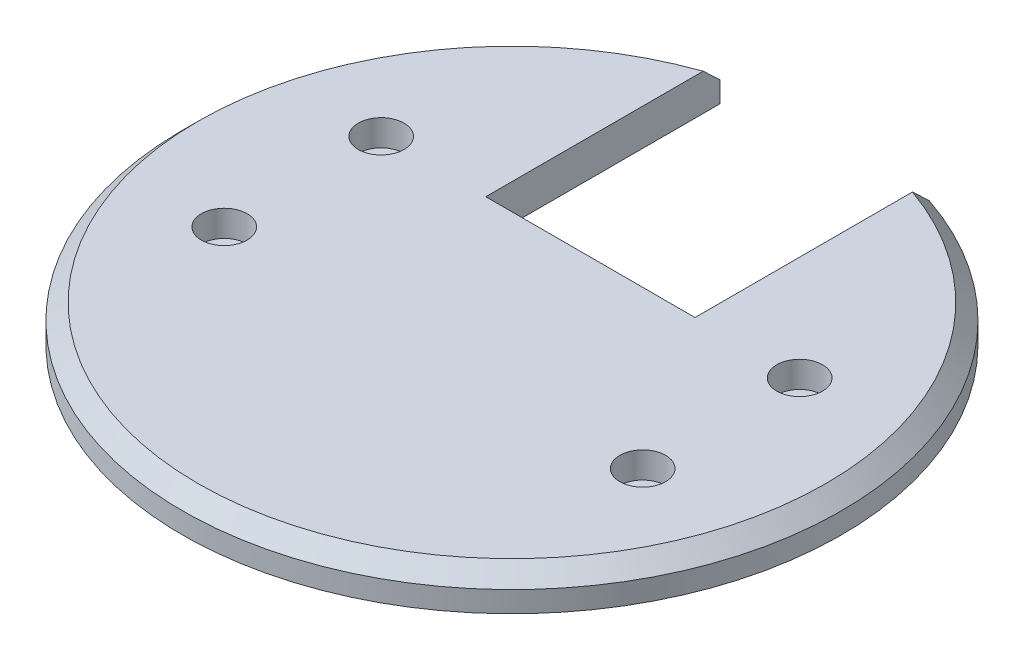
ISO-10303-21;
HEADER;
FILE_DESCRIPTION(('STEP AP214'),'2;1');
FILE_NAME('part.step','',(''),(''),'','','');
FILE_SCHEMA(('AUTOMOTIVE_DESIGN { 1 0 10303 214 1 1 1 1 }'));
ENDSEC;
DATA;
#1=APPLICATION_CONTEXT('core data for automotive mechanical design processes');
#2=APPLICATION_PROTOCOL_DEFINITION('international standard','automotive_design',2000,#1);
#3=PRODUCT_CONTEXT('',#1,'mechanical');
#4=PRODUCT('Part','Part','',(#3));
#5=PRODUCT_RELATED_PRODUCT_CATEGORY('part','',(#4));
#6=PRODUCT_DEFINITION_FORMATION('','',#4);
#7=PRODUCT_DEFINITION_CONTEXT('part definition',#1,'design');
#8=PRODUCT_DEFINITION('design','',#6,#7);
#9=PRODUCT_DEFINITION_SHAPE('','',#8);
#10=(LENGTH_UNIT() NAMED_UNIT(*) SI_UNIT(.MILLI.,.METRE.));
#11=(NAMED_UNIT(*) PLANE_ANGLE_UNIT() SI_UNIT($,.RADIAN.));
#12=(NAMED_UNIT(*) SI_UNIT($,.STERADIAN.) SOLID_ANGLE_UNIT());
#13=UNCERTAINTY_MEASURE_WITH_UNIT(LENGTH_MEASURE(1.E-05),#10,'distance_accuracy_value','');
#14=(GEOMETRIC_REPRESENTATION_CONTEXT(3) GLOBAL_UNCERTAINTY_ASSIGNED_CONTEXT((#13)) GLOBAL_UNIT_ASSIGNED_CONTEXT((#10,
#11,#12)) REPRESENTATION_CONTEXT('',''));
#15=CARTESIAN_POINT('',(0.,0.,0.));
#16=DIRECTION('',(0.,0.,1.));
#17=DIRECTION('',(1.,0.,0.));
#18=AXIS2_PLACEMENT_3D('',#15,#16,#17);
#19=CARTESIAN_POINT('',(0.,7.,0.));
#20=DIRECTION('',(0.,-1.,0.));
#21=DIRECTION('',(0.,0.,-1.));
#22=AXIS2_PLACEMENT_3D('',#19,#20,#21);
#23=CONICAL_SURFACE('',#22,60.,0.785398163397449);
#24=CARTESIAN_POINT('',(-20.,-44.0938586256442,-109.278751019284));
#25=CARTESIAN_POINT('',(-20.,-42.6587972138277,-107.819846186491));
#26=CARTESIAN_POINT('',(-20.,-41.2242020197589,-106.360482593424));
#27=CARTESIAN_POINT('',(-20.,-38.356078376338,-103.440699896279));
#28=CARTESIAN_POINT('',(-20.,-36.9225499298495,-101.980280789387));
#29=CARTESIAN_POINT('',(-20.,-34.0550917197893,-99.0566152678965));
#30=CARTESIAN_POINT('',(-20.,-32.6211633151261,-97.5933675202848));
#31=CARTESIAN_POINT('',(-20.,-29.7546977365026,-94.6655173297269));
#32=CARTESIAN_POINT('',(-20.,-28.3221605591062,-93.2009148901442));
#33=CARTESIAN_POINT('',(-20.,-23.9702852552277,-88.7468333358675));
#34=CARTESIAN_POINT('',(-20.,-21.0534393805988,-85.7549167198976));
#35=CARTESIAN_POINT('',(-20.,-16.6864664473695,-81.2622126374393));
#36=CARTESIAN_POINT('',(-20.,-15.232997096813,-79.7646735347545));
#37=CARTESIAN_POINT('',(-20.,-12.3287291579571,-76.767084873571));
#38=CARTESIAN_POINT('',(-20.,-10.8779304990629,-75.2670353834905));
#39=CARTESIAN_POINT('',(-20.,-8.25010675654438,-72.5443350787468));
#40=CARTESIAN_POINT('',(-20.,-7.07255212665778,-71.3221953945617));
#41=CARTESIAN_POINT('',(-20.,-4.71984593580292,-68.8756053471155));
#42=CARTESIAN_POINT('',(-20.,-3.54469437414055,-67.6511549845221));
#43=CARTESIAN_POINT('',(-20.,-1.19705054279989,-65.199406860862));
#44=CARTESIAN_POINT('',(-20.,-0.0245586322903753,-63.9721087557958));
#45=CARTESIAN_POINT('',(-20.,2.31710895745189,-61.5143538600985));
#46=CARTESIAN_POINT('',(-20.,3.48628463931699,-60.2838970719762));
#47=CARTESIAN_POINT('',(-20.,5.82563202832013,-57.814020473011));
#48=CARTESIAN_POINT('',(-20.,6.99578696810672,-56.574584774925));
#49=CARTESIAN_POINT('',(-20.,9.33129985845173,-54.0911935611308));
#50=CARTESIAN_POINT('',(-20.,10.4966577962476,-52.847238033414));
#51=CARTESIAN_POINT('',(-20.,12.8209573763198,-50.3544591960142));
#52=CARTESIAN_POINT('',(-20.,13.9799018285935,-49.1056385079566));
#53=CARTESIAN_POINT('',(-20.,16.2905379307786,-46.6013187507079));
#54=CARTESIAN_POINT('',(-20.,17.442229642648,-45.3458197387372));
#55=CARTESIAN_POINT('',(-20.,19.7167842705715,-42.8481520753219));
#56=CARTESIAN_POINT('',(-20.,20.8398025304124,-41.6061250005525));
#57=CARTESIAN_POINT('',(-20.,23.0746480759321,-39.1119411904556));
#58=CARTESIAN_POINT('',(-20.,24.1864749675738,-37.8597841012405));
#59=CARTESIAN_POINT('',(-20.,25.84423380682,-35.9706543703594));
#60=CARTESIAN_POINT('',(-20.,26.3956793564934,-35.3385186907539));
#61=CARTESIAN_POINT('',(-20.,27.494288304118,-34.0705389416388));
#62=CARTESIAN_POINT('',(-20.,28.0414517208995,-33.4346948884578));
#63=CARTESIAN_POINT('',(-20.,29.1307521791338,-32.1588280665489));
#64=CARTESIAN_POINT('',(-20.,29.6728897419212,-31.518805743243));
#65=CARTESIAN_POINT('',(-20.,30.751344546525,-30.2338727415136));
#66=CARTESIAN_POINT('',(-20.,31.2876617959194,-29.5889620694564));
#67=CARTESIAN_POINT('',(-20.,32.3490422680546,-28.2988036815317));
#68=CARTESIAN_POINT('',(-20.,32.8741617602435,-27.6536023092659));
#69=CARTESIAN_POINT('',(-20.,33.9163554940932,-26.3567168060797));
#70=CARTESIAN_POINT('',(-20.,34.4334296741783,-25.705032625605));
#71=CARTESIAN_POINT('',(-20.,35.4581672038633,-24.3937433178585));
#72=CARTESIAN_POINT('',(-20.,35.9658254810805,-23.7341342195793));
#73=CARTESIAN_POINT('',(-20.,36.9693516020894,-22.4060066326612));
#74=CARTESIAN_POINT('',(-20.,37.465219677613,-21.7374883195333));
#75=CARTESIAN_POINT('',(-20.,38.440847191911,-20.392133899314));
#76=CARTESIAN_POINT('',(-20.,38.9206543920104,-19.715332523911));
#77=CARTESIAN_POINT('',(-20.,39.8623869683305,-18.3492510341708));
#78=CARTESIAN_POINT('',(-20.,40.3243106228426,-17.6599697276781));
#79=CARTESIAN_POINT('',(-20.,41.2250754636134,-16.267407122803));
#80=CARTESIAN_POINT('',(-20.,41.6639391202453,-15.564140409518));
#81=CARTESIAN_POINT('',(-20.,42.5127518210924,-14.1404404748173));
#82=CARTESIAN_POINT('',(-20.,42.9227092459522,-13.4200123106508));
#83=CARTESIAN_POINT('',(-20.,43.399454442174,-12.530115507796));
#84=CARTESIAN_POINT('',(-20.,43.48402850081,-12.370111351747));
#85=CARTESIAN_POINT('',(-20.,43.6512952231954,-12.0490999884837));
#86=CARTESIAN_POINT('',(-20.,43.7339876968287,-11.888092681986));
#87=CARTESIAN_POINT('',(-20.,43.8973914423958,-11.5650307886412));
#88=CARTESIAN_POINT('',(-20.,43.9781022740529,-11.4029759789868));
#89=CARTESIAN_POINT('',(-20.,44.1374037851363,-11.0778332636922));
#90=CARTESIAN_POINT('',(-20.,44.2159945117433,-10.9147453811418));
#91=CARTESIAN_POINT('',(-20.,44.4484105675349,-10.4238805324975));
#92=CARTESIAN_POINT('',(-20.,44.5988794391697,-10.0945030226553));
#93=CARTESIAN_POINT('',(-20.,44.8897835647085,-9.43135473756902));
#94=CARTESIAN_POINT('',(-20.,45.030219138229,-9.09758410267203));
#95=CARTESIAN_POINT('',(-20.,45.2983744907944,-8.42930230272086));
#96=CARTESIAN_POINT('',(-20.,45.4262194680902,-8.09484164195621));
#97=CARTESIAN_POINT('',(-20.,45.66972641472,-7.42153228030017));
#98=CARTESIAN_POINT('',(-20.,45.7853883270457,-7.08268355888398));
#99=CARTESIAN_POINT('',(-20.,46.1121727336376,-6.05959019843374));
#100=CARTESIAN_POINT('',(-20.,46.303138217991,-5.36868996779358));
#101=CARTESIAN_POINT('',(-20.,46.5926023319047,-4.0957040267542));
#102=CARTESIAN_POINT('',(-20.,46.7014836204733,-3.51599672089998));
#103=CARTESIAN_POINT('',(-20.,46.828411585652,-2.64129008260976));
#104=CARTESIAN_POINT('',(-20.,46.8646549279308,-2.34886879048263));
#105=CARTESIAN_POINT('',(-20.,46.9245826041489,-1.76275111713538));
#106=CARTESIAN_POINT('',(-20.,46.9482680560253,-1.46905485176441));
#107=CARTESIAN_POINT('',(-20.,46.9827461361909,-0.881184224365239));
#108=CARTESIAN_POINT('',(-20.,46.993550885245,-0.587010573058123));
#109=CARTESIAN_POINT('',(-20.,47.0021642975362,0.00151613478384979));
#110=CARTESIAN_POINT('',(-20.,46.999973461786,0.295869183964998));
#111=CARTESIAN_POINT('',(-20.,46.9826227197966,0.884219102612073));
#112=CARTESIAN_POINT('',(-20.,46.9674617604489,1.17821594121434));
#113=CARTESIAN_POINT('',(-20.,46.9243822332862,1.76528167887092));
#114=CARTESIAN_POINT('',(-20.,46.8964624811493,2.05835048923851));
#115=CARTESIAN_POINT('',(-20.,46.7944440860549,2.93212862056648));
#116=CARTESIAN_POINT('',(-20.,46.7019798210117,3.51077380264643));
#117=CARTESIAN_POINT('',(-20.,46.4722123199871,4.65908467918978));
#118=CARTESIAN_POINT('',(-20.,46.3348978276106,5.22874808176568));
#119=CARTESIAN_POINT('',(-20.,46.0992630193832,6.07575165825168));
#120=CARTESIAN_POINT('',(-20.,46.015617918999,6.35727807574965));
#121=CARTESIAN_POINT('',(-20.,45.8391988086944,6.91737721462457));
#122=CARTESIAN_POINT('',(-20.,45.7464273908579,7.19595074992999));
#123=CARTESIAN_POINT('',(-20.,45.5524562937252,7.7501301657607));
#124=CARTESIAN_POINT('',(-20.,45.4512568043682,8.02573611300704));
#125=CARTESIAN_POINT('',(-20.,45.241108130124,8.57400048032841));
#126=CARTESIAN_POINT('',(-20.,45.1321581738042,8.84665860387552));
#127=CARTESIAN_POINT('',(-20.,44.8478405518972,9.53206488192905));
#128=CARTESIAN_POINT('',(-20.,44.6677483931793,9.94285738637161));
#129=CARTESIAN_POINT('',(-20.,44.293172131467,10.7578353554232));
#130=CARTESIAN_POINT('',(-20.,44.098686702214,11.1620202069745));
#131=CARTESIAN_POINT('',(-20.,43.6971125992904,11.9643319131114));
#132=CARTESIAN_POINT('',(-20.,43.4900172703223,12.3624554276143));
#133=CARTESIAN_POINT('',(-20.,43.064966753611,13.1528251111232));
#134=CARTESIAN_POINT('',(-20.,42.847011986728,13.5450715071334));
#135=CARTESIAN_POINT('',(-20.,42.4011358245613,14.3250395880335));
#136=CARTESIAN_POINT('',(-20.,42.1731927411328,14.7127488490391));
#137=CARTESIAN_POINT('',(-20.,41.7090093209318,15.4831725666308));
#138=CARTESIAN_POINT('',(-20.,41.4727686958431,15.8658868490203));
#139=CARTESIAN_POINT('',(-20.,40.7533277515231,17.0069732049219));
#140=CARTESIAN_POINT('',(-20.,40.2592776832786,17.7585146510228));
#141=CARTESIAN_POINT('',(-20.,39.2458155889927,19.2508742276194));
#142=CARTESIAN_POINT('',(-20.,38.7262675188868,19.9915992691261));
#143=CARTESIAN_POINT('',(-20.,37.6694080710633,21.4602787431369));
#144=CARTESIAN_POINT('',(-20.,37.1320959373947,22.1882326301408));
#145=CARTESIAN_POINT('',(-20.,36.0439921513049,23.6325951764159));
#146=CARTESIAN_POINT('',(-20.,35.4932174234258,24.3490166253771));
#147=CARTESIAN_POINT('',(-20.,34.3802823796512,25.7729149766025));
#148=CARTESIAN_POINT('',(-20.,33.8181223534208,26.4803921056864));
#149=CARTESIAN_POINT('',(-20.,32.8477130134133,27.6851347395065));
#150=CARTESIAN_POINT('',(-20.,32.4417659240536,28.1842593864166));
#151=CARTESIAN_POINT('',(-20.,31.625664298906,29.1791811975728));
#152=CARTESIAN_POINT('',(-20.,31.2155091438746,29.6749778537976));
#153=CARTESIAN_POINT('',(-20.,30.3949131410623,30.6595144839464));
#154=CARTESIAN_POINT('',(-20.,29.9845017724559,31.1482790513356));
#155=CARTESIAN_POINT('',(-20.,29.1605685362434,32.1230454108726));
#156=CARTESIAN_POINT('',(-20.,28.7470471791246,32.6090476344018));
#157=CARTESIAN_POINT('',(-20.,28.332138942862,33.0938586256442));
#158=B_SPLINE_CURVE_WITH_KNOTS('',3,(#24,#25,#26,#27,#28,#29,#30,#31,#32,#33,#34,#35,#36,#37,
#38,#39,#40,#41,#42,#43,#44,#45,#46,#47,#48,#49,#50,#51,#52,#53,#54,#55,#56,#57,#58,#59,#60,#61,
#62,#63,#64,#65,#66,#67,#68,#69,#70,#71,#72,#73,#74,#75,#76,#77,#78,#79,#80,#81,#82,#83,#84,#85,
#86,#87,#88,#89,#90,#91,#92,#93,#94,#95,#96,#97,#98,#99,#100,#101,#102,#103,#104,#105,#106,#107,
#108,#109,#110,#111,#112,#113,#114,#115,#116,#117,#118,#119,#120,#121,#122,#123,#124,#125,#126,
#127,#128,#129,#130,#131,#132,#133,#134,#135,#136,#137,#138,#139,#140,#141,#142,#143,#144,#145,
#146,#147,#148,#149,#150,#151,#152,#153,#154,#155,#156,#157),.UNSPECIFIED.,.F.,.F.,(4,2,2,2,2,2,
2,2,2,2,2,2,2,2,2,2,2,2,2,2,2,2,2,2,2,2,2,2,2,2,2,2,2,2,2,2,2,2,2,2,2,2,2,2,2,2,2,2,2,2,2,2,2,2,
2,2,2,2,2,2,2,2,2,2,2,2,4),(0.,6.13923787692803,12.2784921752611,18.4246446086491,
24.5707818226674,37.1061546521919,43.3668845523999,49.6274465144436,54.7188427011631,
59.8102374170765,64.9022830157099,69.9943245712697,75.1079401189929,80.221569262877,
85.3327451447831,90.4438773041652,95.4671952883453,100.490689524287,103.007257191667,
105.523813786405,108.040106348832,110.55639563472,113.052001593277,115.54762664281,
118.044559182024,120.541442604341,123.030085761417,125.518967915704,128.005378052895,
130.49106432757,131.033999057476,131.576988404268,132.120097319097,132.663194137667,
133.749389985182,134.835551215865,135.909502288227,136.983458385723,139.131020144007,
140.89856851031,141.782311534364,142.665975872029,143.548808021914,144.431606136593,
145.314475936817,146.197427705176,147.953267464466,149.70954823897,150.590487163034,
151.471176598648,152.351846191975,153.232603564568,154.577866811217,155.923254170976,
157.269357864565,158.615409430087,159.964544585741,161.313726666506,164.011308560422,
166.725306614006,169.439420310989,172.150281594369,174.861073994368,176.791146880397,
178.721507983213,180.636162346628,182.550509006438),.UNSPECIFIED.);
#159=CARTESIAN_POINT('',(-20.,4.,-59.7411081249754));
#160=VERTEX_POINT('',#159);
#161=CARTESIAN_POINT('',(-20.,7.,-56.5685424949238));
#162=VERTEX_POINT('',#161);
#163=EDGE_CURVE('E89',#160,#162,#158,.T.);
#164=ORIENTED_EDGE('',*,*,#163,.F.);
#165=CARTESIAN_POINT('',(0.,4.,0.));
#166=DIRECTION('',(0.,1.,0.));
#167=DIRECTION('',(0.,0.,1.));
#168=AXIS2_PLACEMENT_3D('',#165,#166,#167);
#169=CIRCLE('',#168,63.);
#170=CARTESIAN_POINT('',(20.,4.,-59.7411081249754));
#171=VERTEX_POINT('',#170);
#172=EDGE_CURVE('E202',#171,#160,#169,.F.);
#173=ORIENTED_EDGE('',*,*,#172,.F.);
#174=CARTESIAN_POINT('',(20.,28.332138942862,33.0938586256442));
#175=CARTESIAN_POINT('',(20.,28.7553853093071,32.5993031414979));
#176=CARTESIAN_POINT('',(20.,29.1771897790082,32.1035086939061));
#177=CARTESIAN_POINT('',(20.,30.0174939444251,31.1091114326064));
#178=CARTESIAN_POINT('',(20.,30.4359935760711,30.6105085647718));
#179=CARTESIAN_POINT('',(20.,31.2694639068695,29.6099271500543));
#180=CARTESIAN_POINT('',(20.,31.6844326903373,29.1079470061348));
#181=CARTESIAN_POINT('',(20.,32.5100923511322,28.1004818674759));
#182=CARTESIAN_POINT('',(20.,32.9207832456655,27.594996886847));
#183=CARTESIAN_POINT('',(20.,33.7481819808724,26.566505211562));
#184=CARTESIAN_POINT('',(20.,34.1647569269306,26.0433915009927));
#185=CARTESIAN_POINT('',(20.,34.9919156593285,24.9924499252665));
#186=CARTESIAN_POINT('',(20.,35.4024994907836,24.464622095657));
#187=CARTESIAN_POINT('',(20.,36.216585684637,23.4037237536273));
#188=CARTESIAN_POINT('',(20.,36.6200896921455,22.8706545052881));
#189=CARTESIAN_POINT('',(20.,37.418891244514,21.7983930233435));
#190=CARTESIAN_POINT('',(20.,37.8141887948616,21.2592007938328));
#191=CARTESIAN_POINT('',(20.,38.5957844920396,20.1728058849477));
#192=CARTESIAN_POINT('',(20.,38.982064661882,19.6255902458985));
#193=CARTESIAN_POINT('',(20.,39.7429721013227,18.523086806295));
#194=CARTESIAN_POINT('',(20.,40.1175992355346,17.967798912066));
#195=CARTESIAN_POINT('',(20.,40.8531334603274,16.8474734699388));
#196=CARTESIAN_POINT('',(20.,41.2140280508665,16.2824276892837));
#197=CARTESIAN_POINT('',(20.,41.9187093527815,15.1417414174548));
#198=CARTESIAN_POINT('',(20.,42.2624964323239,14.5661011546477));
#199=CARTESIAN_POINT('',(20.,42.9258877021377,13.4084205487893));
#200=CARTESIAN_POINT('',(20.,43.2456946406613,12.8264969720867));
#201=CARTESIAN_POINT('',(20.,43.8601065283423,11.6493254661695));
#202=CARTESIAN_POINT('',(20.,44.1547085299986,11.0540759888463));
#203=CARTESIAN_POINT('',(20.,44.7123711684902,9.85000246436947));
#204=CARTESIAN_POINT('',(20.,44.9754811793877,9.24120148949827));
#205=CARTESIAN_POINT('',(20.,45.4635546045604,8.00865658214709));
#206=CARTESIAN_POINT('',(20.,45.6885332132992,7.38491871527887));
#207=CARTESIAN_POINT('',(20.,46.0986202930395,6.10302786637511));
#208=CARTESIAN_POINT('',(20.,46.2822954999512,5.44440600693097));
#209=CARTESIAN_POINT('',(20.,46.5142490214522,4.4464473862988));
#210=CARTESIAN_POINT('',(20.,46.5843111976726,4.11209389433712));
#211=CARTESIAN_POINT('',(20.,46.7089078851433,3.44052238507297));
#212=CARTESIAN_POINT('',(20.,46.7634445162654,3.10330476532264));
#213=CARTESIAN_POINT('',(20.,46.8559105841592,2.42810415228909));
#214=CARTESIAN_POINT('',(20.,46.8939119479779,2.09013103464397));
#215=CARTESIAN_POINT('',(20.,46.9530078191238,1.41270384440433));
#216=CARTESIAN_POINT('',(20.,46.9741024629674,1.07324978379021));
#217=CARTESIAN_POINT('',(20.,46.9990068895789,0.393711329390264));
#218=CARTESIAN_POINT('',(20.,47.0028169829028,0.0536269470394219));
#219=CARTESIAN_POINT('',(20.,46.9930839005068,-0.626292757077159));
#220=CARTESIAN_POINT('',(20.,46.9795406932447,-0.966128078389071));
#221=CARTESIAN_POINT('',(20.,46.9353815855267,-1.64413171573366));
#222=CARTESIAN_POINT('',(20.,46.9047932537172,-1.98230183631131));
#223=CARTESIAN_POINT('',(20.,46.8270976759026,-2.65672910820431));
#224=CARTESIAN_POINT('',(20.,46.779990385128,-2.99298625433264));
#225=CARTESIAN_POINT('',(20.,46.6700269505948,-3.66292045160269));
#226=CARTESIAN_POINT('',(20.,46.6071702876768,-3.99659741731798));
#227=CARTESIAN_POINT('',(20.,46.4666625896435,-4.66083611546385));
#228=CARTESIAN_POINT('',(20.,46.3890094391464,-4.9913973953598));
#229=CARTESIAN_POINT('',(20.,46.134514012281,-5.98133935377019));
#230=CARTESIAN_POINT('',(20.,45.9367353698613,-6.6354418451822));
#231=CARTESIAN_POINT('',(20.,45.6053025769032,-7.60429952150377));
#232=CARTESIAN_POINT('',(20.,45.489023685303,-7.9252195879882));
#233=CARTESIAN_POINT('',(20.,45.2459342690937,-8.56307514512836));
#234=CARTESIAN_POINT('',(20.,45.1191235232306,-8.88001055191298));
#235=CARTESIAN_POINT('',(20.,44.813687655587,-9.61122083313089));
#236=CARTESIAN_POINT('',(20.,44.6315170217795,-10.0240119782427));
#237=CARTESIAN_POINT('',(20.,44.252741766684,-10.8429500686777));
#238=CARTESIAN_POINT('',(20.,44.0561353313811,-11.249096171111));
#239=CARTESIAN_POINT('',(20.,43.6503040153436,-12.0552759115665));
#240=CARTESIAN_POINT('',(20.,43.4410727254684,-12.4553063135194));
#241=CARTESIAN_POINT('',(20.,43.0117419932296,-13.2494564392423));
#242=CARTESIAN_POINT('',(20.,42.7916429390322,-13.6435763734632));
#243=CARTESIAN_POINT('',(20.,42.3415051458617,-14.4272130107661));
#244=CARTESIAN_POINT('',(20.,42.1114460793723,-14.8167180128638));
#245=CARTESIAN_POINT('',(20.,41.6430354386731,-15.5907173856144));
#246=CARTESIAN_POINT('',(20.,41.4046835235562,-15.9752115493838));
#247=CARTESIAN_POINT('',(20.,40.6789232242653,-17.1216172554365));
#248=CARTESIAN_POINT('',(20.,40.1806785138118,-17.876678679562));
#249=CARTESIAN_POINT('',(20.,39.158450264461,-19.3766547372151));
#250=CARTESIAN_POINT('',(20.,38.63431357366,-20.1214641975227));
#251=CARTESIAN_POINT('',(20.,37.5682983373363,-21.5982921534571));
#252=CARTESIAN_POINT('',(20.,37.0264190938105,-22.330310144118));
#253=CARTESIAN_POINT('',(20.,36.2034020125327,-23.4197933553117));
#254=CARTESIAN_POINT('',(20.,35.927559526815,-23.7812809191158));
#255=CARTESIAN_POINT('',(20.,35.3727013078413,-24.5018143772972));
#256=CARTESIAN_POINT('',(20.,35.0936855747596,-24.8608602718086));
#257=CARTESIAN_POINT('',(20.,34.5328123504906,-25.576702809845));
#258=CARTESIAN_POINT('',(20.,34.2509549617701,-25.9334995337238));
#259=CARTESIAN_POINT('',(20.,33.6846621944588,-26.6450386784676));
#260=CARTESIAN_POINT('',(20.,33.4002268207607,-26.9997811032293));
#261=CARTESIAN_POINT('',(20.,32.451154385908,-28.1754948479202));
#262=CARTESIAN_POINT('',(20.,31.7813943889197,-28.9923349992085));
#263=CARTESIAN_POINT('',(20.,30.4317752228923,-30.6176391425363));
#264=CARTESIAN_POINT('',(20.,29.7519158113311,-31.4261029326364));
#265=CARTESIAN_POINT('',(20.,28.3838976625009,-33.0360937199149));
#266=CARTESIAN_POINT('',(20.,27.6957382012028,-33.8376201013006));
#267=CARTESIAN_POINT('',(20.,26.3126164314234,-35.4347649347405));
#268=CARTESIAN_POINT('',(20.,25.6176541717786,-36.2303834291347));
#269=CARTESIAN_POINT('',(20.,24.2218343250297,-37.8168426935589));
#270=CARTESIAN_POINT('',(20.,23.5209750672517,-38.6076819925409));
#271=CARTESIAN_POINT('',(20.,22.1144473080509,-40.1850751542392));
#272=CARTESIAN_POINT('',(20.,21.408778787277,-40.9716289996892));
#273=CARTESIAN_POINT('',(20.,19.9933393490294,-42.5410510300593));
#274=CARTESIAN_POINT('',(20.,19.2835683850283,-43.323919172995));
#275=CARTESIAN_POINT('',(20.,17.8605092920578,-44.8864526039254));
#276=CARTESIAN_POINT('',(20.,17.1472211587636,-45.6661178879798));
#277=CARTESIAN_POINT('',(20.,15.7166952819248,-47.2236414928453));
#278=CARTESIAN_POINT('',(20.,14.9994536737112,-48.0014962628381));
#279=CARTESIAN_POINT('',(20.,13.5623207815857,-49.5547408828056));
#280=CARTESIAN_POINT('',(20.,12.842429520822,-50.3301307542044));
#281=CARTESIAN_POINT('',(20.,11.400311465739,-51.8787529406646));
#282=CARTESIAN_POINT('',(20.,10.6780846426846,-52.6519852289609));
#283=CARTESIAN_POINT('',(20.,9.2315777156569,-54.1965297031024));
#284=CARTESIAN_POINT('',(20.,8.50729760682253,-54.9678418843936));
#285=CARTESIAN_POINT('',(20.,6.33201213146621,-57.2789325823488));
#286=CARTESIAN_POINT('',(20.,4.87829105272716,-58.8161554293348));
#287=CARTESIAN_POINT('',(20.,1.96510592141075,-61.8851357529868));
#288=CARTESIAN_POINT('',(20.,0.50564188717915,-63.416893247082));
#289=CARTESIAN_POINT('',(20.,-2.41165947765552,-66.4693863265881));
#290=CARTESIAN_POINT('',(20.,-3.869476851544,-67.9901409906834));
#291=CARTESIAN_POINT('',(20.,-6.78890077504695,-71.0280096859724));
#292=CARTESIAN_POINT('',(20.,-8.25050732734207,-72.545123714589));
#293=CARTESIAN_POINT('',(20.,-11.1769341927189,-75.5763798275904));
#294=CARTESIAN_POINT('',(20.,-12.6417546470299,-77.0905217755993));
#295=CARTESIAN_POINT('',(20.,-15.5740446472243,-80.1162387045838));
#296=CARTESIAN_POINT('',(20.,-17.0415141939513,-81.6278136847416));
#297=CARTESIAN_POINT('',(20.,-21.4458477100201,-86.1578130649732));
#298=CARTESIAN_POINT('',(20.,-24.3860586929977,-89.172983301458));
#299=CARTESIAN_POINT('',(20.,-30.273011272336,-95.1968750816766));
#300=CARTESIAN_POINT('',(20.,-33.2197527987221,-98.2055966938343));
#301=CARTESIAN_POINT('',(20.,-36.8287217275998,-101.884347575897));
#302=CARTESIAN_POINT('',(20.,-37.4885739326665,-102.556708154625));
#303=CARTESIAN_POINT('',(20.,-38.8085441940613,-103.901224345958));
#304=CARTESIAN_POINT('',(20.,-39.4686622604795,-104.57337994866));
#305=CARTESIAN_POINT('',(20.,-40.7895177848855,-105.917873352628));
#306=CARTESIAN_POINT('',(20.,-41.4502553770854,-106.590211022035));
#307=CARTESIAN_POINT('',(20.,-42.7719148014028,-107.934648976554));
#308=CARTESIAN_POINT('',(20.,-43.4328366244806,-108.606749270551));
#309=CARTESIAN_POINT('',(20.,-44.0938586256442,-109.278751019284));
#310=B_SPLINE_CURVE_WITH_KNOTS('',3,(#174,#175,#176,#177,#178,#179,#180,#181,#182,#183,#184,
#185,#186,#187,#188,#189,#190,#191,#192,#193,#194,#195,#196,#197,#198,#199,#200,#201,#202,#203,
#204,#205,#206,#207,#208,#209,#210,#211,#212,#213,#214,#215,#216,#217,#218,#219,#220,#221,#222,
#223,#224,#225,#226,#227,#228,#229,#230,#231,#232,#233,#234,#235,#236,#237,#238,#239,#240,#241,
#242,#243,#244,#245,#246,#247,#248,#249,#250,#251,#252,#253,#254,#255,#256,#257,#258,#259,#260,
#261,#262,#263,#264,#265,#266,#267,#268,#269,#270,#271,#272,#273,#274,#275,#276,#277,#278,#279,
#280,#281,#282,#283,#284,#285,#286,#287,#288,#289,#290,#291,#292,#293,#294,#295,#296,#297,#298,
#299,#300,#301,#302,#303,#304,#305,#306,#307,#308,#309),.UNSPECIFIED.,.F.,.F.,(4,2,2,2,2,2,2,2,
2,2,2,2,2,2,2,2,2,2,2,2,2,2,2,2,2,2,2,2,2,2,2,2,2,2,2,2,2,2,2,2,2,2,2,2,2,2,2,2,2,2,2,2,2,2,2,2,
2,2,2,2,2,2,2,2,2,2,2,4),(0.,1.95282220586863,3.90568217804563,5.85954160197015,
7.81339316422442,9.81950693957901,11.8256056003027,13.8312317678924,15.8368565943365,
17.8461870692599,19.8555408801212,21.86668196291,23.8777797457085,25.8693100001205,
27.8610728294819,29.8496708335927,31.8374745557896,33.8862005502859,34.910742566958,
35.935144624573,36.9550449522536,37.9749370444731,38.9948108119471,40.0146864331901,
41.0329172836891,42.0511508938067,43.0694180731983,44.0878309386625,46.1353820597913,
47.1592672531336,48.1831739617625,49.5364513662189,50.8898991166608,52.2440398362519,
53.5981322246637,54.9551320878358,56.3121878013831,59.0255132280829,61.7574564794407,
64.4895073365811,65.8536282570763,67.2177491026666,68.5818209343126,69.9458901776365,
73.1147270958859,76.2836402323271,79.4528318276083,82.6220006882815,85.7920998507073,
88.9622117761953,92.1323597259402,95.30251157455,98.4766882207017,101.650837201946,
104.825025385486,107.999221090113,114.346422276728,120.693603203754,127.013510985624,
133.333423239699,139.653619007534,145.97381678822,158.608073374462,171.242195233154,
174.06836987018,176.894664395786,179.722651084583,182.550517397331),.UNSPECIFIED.);
#311=CARTESIAN_POINT('',(20.,7.,-56.5685424949238));
#312=VERTEX_POINT('',#311);
#313=EDGE_CURVE('E55',#312,#171,#310,.T.);
#314=ORIENTED_EDGE('',*,*,#313,.F.);
#315=CARTESIAN_POINT('',(0.,7.,0.));
#316=DIRECTION('',(0.,1.,0.));
#317=DIRECTION('',(0.,0.,1.));
#318=AXIS2_PLACEMENT_3D('',#315,#316,#317);
#319=CIRCLE('',#318,60.);
#320=EDGE_CURVE('E203',#162,#312,#319,.T.);
#321=ORIENTED_EDGE('',*,*,#320,.F.);
#322=EDGE_LOOP('',(#164,#173,#314,#321));
#323=FACE_BOUND('',#322,.T.);
#324=ADVANCED_FACE('F39',(#323),#23,.T.);
#325=CARTESIAN_POINT('',(-40.,7.,-15.));
#326=DIRECTION('',(0.,-1.,0.));
#327=DIRECTION('',(0.,0.,-1.));
#328=AXIS2_PLACEMENT_3D('',#325,#326,#327);
#329=CYLINDRICAL_SURFACE('',#328,2.625);
#330=CARTESIAN_POINT('',(-40.,0.,-15.));
#331=DIRECTION('',(0.,1.,0.));
#332=DIRECTION('',(0.,0.,1.));
#333=AXIS2_PLACEMENT_3D('',#330,#331,#332);
#334=CIRCLE('',#333,2.625);
#335=CARTESIAN_POINT('',(-40.,0.,-12.375));
#336=VERTEX_POINT('',#335);
#337=EDGE_CURVE('E226',#336,#336,#334,.T.);
#338=ORIENTED_EDGE('',*,*,#337,.F.);
#339=EDGE_LOOP('',(#338));
#340=FACE_BOUND('',#339,.T.);
#341=CARTESIAN_POINT('',(-40.,2.,-15.));
#342=DIRECTION('',(0.,1.,0.));
#343=DIRECTION('',(0.,0.,1.));
#344=AXIS2_PLACEMENT_3D('',#341,#342,#343);
#345=CIRCLE('',#344,2.625);
#346=CARTESIAN_POINT('',(-40.,2.,-12.375));
#347=VERTEX_POINT('',#346);
#348=EDGE_CURVE('E211',#347,#347,#345,.T.);
#349=ORIENTED_EDGE('',*,*,#348,.T.);
#350=EDGE_LOOP('',(#349));
#351=FACE_BOUND('',#350,.T.);
#352=ADVANCED_FACE('F180',(#340,#351),#329,.F.);
#353=CARTESIAN_POINT('',(-40.,7.,15.));
#354=DIRECTION('',(0.,-1.,0.));
#355=DIRECTION('',(0.,0.,-1.));
#356=AXIS2_PLACEMENT_3D('',#353,#354,#355);
#357=CYLINDRICAL_SURFACE('',#356,2.625);
#358=CARTESIAN_POINT('',(-40.,0.,15.));
#359=DIRECTION('',(0.,1.,0.));
#360=DIRECTION('',(0.,0.,1.));
#361=AXIS2_PLACEMENT_3D('',#358,#359,#360);
#362=CIRCLE('',#361,2.625);
#363=CARTESIAN_POINT('',(-40.,0.,17.625));
#364=VERTEX_POINT('',#363);
#365=EDGE_CURVE('E229',#364,#364,#362,.T.);
#366=ORIENTED_EDGE('',*,*,#365,.F.);
#367=EDGE_LOOP('',(#366));
#368=FACE_BOUND('',#367,.T.);
#369=CARTESIAN_POINT('',(-40.,2.,15.));
#370=DIRECTION('',(0.,1.,0.));
#371=DIRECTION('',(0.,0.,1.));
#372=AXIS2_PLACEMENT_3D('',#369,#370,#371);
#373=CIRCLE('',#372,2.625);
#374=CARTESIAN_POINT('',(-40.,2.,17.625));
#375=VERTEX_POINT('',#374);
#376=EDGE_CURVE('E215',#375,#375,#373,.T.);
#377=ORIENTED_EDGE('',*,*,#376,.T.);
#378=EDGE_LOOP('',(#377));
#379=FACE_BOUND('',#378,.T.);
#380=ADVANCED_FACE('F176',(#368,#379),#357,.F.);
#381=CARTESIAN_POINT('',(40.,7.,-15.));
#382=DIRECTION('',(0.,-1.,0.));
#383=DIRECTION('',(0.,0.,-1.));
#384=AXIS2_PLACEMENT_3D('',#381,#382,#383);
#385=CYLINDRICAL_SURFACE('',#384,2.625);
#386=CARTESIAN_POINT('',(40.,0.,-15.));
#387=DIRECTION('',(0.,1.,0.));
#388=DIRECTION('',(0.,0.,1.));
#389=AXIS2_PLACEMENT_3D('',#386,#387,#388);
#390=CIRCLE('',#389,2.625);
#391=CARTESIAN_POINT('',(40.,0.,-12.375));
#392=VERTEX_POINT('',#391);
#393=EDGE_CURVE('E232',#392,#392,#390,.T.);
#394=ORIENTED_EDGE('',*,*,#393,.F.);
#395=EDGE_LOOP('',(#394));
#396=FACE_BOUND('',#395,.T.);
#397=CARTESIAN_POINT('',(40.,2.,-15.));
#398=DIRECTION('',(0.,1.,0.));
#399=DIRECTION('',(0.,0.,1.));
#400=AXIS2_PLACEMENT_3D('',#397,#398,#399);
#401=CIRCLE('',#400,2.625);
#402=CARTESIAN_POINT('',(40.,2.,-12.375));
#403=VERTEX_POINT('',#402);
#404=EDGE_CURVE('E218',#403,#403,#401,.T.);
#405=ORIENTED_EDGE('',*,*,#404,.T.);
#406=EDGE_LOOP('',(#405));
#407=FACE_BOUND('',#406,.T.);
#408=ADVANCED_FACE('F172',(#396,#407),#385,.F.);
#409=CARTESIAN_POINT('',(40.,7.,15.));
#410=DIRECTION('',(0.,-1.,0.));
#411=DIRECTION('',(0.,0.,-1.));
#412=AXIS2_PLACEMENT_3D('',#409,#410,#411);
#413=CYLINDRICAL_SURFACE('',#412,2.625);
#414=CARTESIAN_POINT('',(40.,0.,15.));
#415=DIRECTION('',(0.,1.,0.));
#416=DIRECTION('',(0.,0.,1.));
#417=AXIS2_PLACEMENT_3D('',#414,#415,#416);
#418=CIRCLE('',#417,2.625);
#419=CARTESIAN_POINT('',(40.,0.,17.625));
#420=VERTEX_POINT('',#419);
#421=EDGE_CURVE('E214',#420,#420,#418,.T.);
#422=ORIENTED_EDGE('',*,*,#421,.F.);
#423=EDGE_LOOP('',(#422));
#424=FACE_BOUND('',#423,.T.);
#425=CARTESIAN_POINT('',(40.,2.,15.));
#426=DIRECTION('',(0.,1.,0.));
#427=DIRECTION('',(0.,0.,1.));
#428=AXIS2_PLACEMENT_3D('',#425,#426,#427);
#429=CIRCLE('',#428,2.625);
#430=CARTESIAN_POINT('',(40.,2.,17.625));
#431=VERTEX_POINT('',#430);
#432=EDGE_CURVE('E221',#431,#431,#429,.T.);
#433=ORIENTED_EDGE('',*,*,#432,.T.);
#434=EDGE_LOOP('',(#433));
#435=FACE_BOUND('',#434,.T.);
#436=ADVANCED_FACE('F169',(#424,#435),#413,.F.);
#437=CARTESIAN_POINT('',(0.,7.,0.));
#438=DIRECTION('',(0.,1.,0.));
#439=DIRECTION('',(0.,0.,1.));
#440=AXIS2_PLACEMENT_3D('',#437,#438,#439);
#441=PLANE('',#440);
#442=DIRECTION('',(0.,0.,1.));
#443=VECTOR('',#442,1.);
#444=CARTESIAN_POINT('',(-20.,7.,-15.));
#445=LINE('',#444,#443);
#446=CARTESIAN_POINT('',(-20.,7.,-15.));
#447=VERTEX_POINT('',#446);
#448=EDGE_CURVE('E84',#162,#447,#445,.T.);
#449=ORIENTED_EDGE('',*,*,#448,.F.);
#450=ORIENTED_EDGE('',*,*,#320,.T.);
#451=DIRECTION('',(0.,0.,-1.));
#452=VECTOR('',#451,1.);
#453=CARTESIAN_POINT('',(20.,7.,-15.));
#454=LINE('',#453,#452);
#455=CARTESIAN_POINT('',(20.,7.,-15.));
#456=VERTEX_POINT('',#455);
#457=EDGE_CURVE('E104',#456,#312,#454,.T.);
#458=ORIENTED_EDGE('',*,*,#457,.F.);
#459=DIRECTION('',(1.,0.,0.));
#460=VECTOR('',#459,1.);
#461=CARTESIAN_POINT('',(20.,7.,-15.));
#462=LINE('',#461,#460);
#463=EDGE_CURVE('E94',#447,#456,#462,.T.);
#464=ORIENTED_EDGE('',*,*,#463,.F.);
#465=EDGE_LOOP('',(#449,#450,#458,#464));
#466=FACE_BOUND('',#465,.T.);
#467=CARTESIAN_POINT('',(-40.,7.,15.));
#468=DIRECTION('',(0.,1.,0.));
#469=DIRECTION('',(0.,0.,1.));
#470=AXIS2_PLACEMENT_3D('',#467,#468,#469);
#471=CIRCLE('',#470,4.375);
#472=CARTESIAN_POINT('',(-40.,7.,19.375));
#473=VERTEX_POINT('',#472);
#474=EDGE_CURVE('E250',#473,#473,#471,.T.);
#475=ORIENTED_EDGE('',*,*,#474,.F.);
#476=EDGE_LOOP('',(#475));
#477=FACE_BOUND('',#476,.T.);
#478=CARTESIAN_POINT('',(40.,7.,-15.));
#479=DIRECTION('',(0.,1.,0.));
#480=DIRECTION('',(0.,0.,1.));
#481=AXIS2_PLACEMENT_3D('',#478,#479,#480);
#482=CIRCLE('',#481,4.37500000000001);
#483=CARTESIAN_POINT('',(40.,7.,-10.625));
#484=VERTEX_POINT('',#483);
#485=EDGE_CURVE('E243',#484,#484,#482,.T.);
#486=ORIENTED_EDGE('',*,*,#485,.F.);
#487=EDGE_LOOP('',(#486));
#488=FACE_BOUND('',#487,.T.);
#489=CARTESIAN_POINT('',(40.,7.,15.));
#490=DIRECTION('',(0.,1.,0.));
#491=DIRECTION('',(0.,0.,1.));
#492=AXIS2_PLACEMENT_3D('',#489,#490,#491);
#493=CIRCLE('',#492,4.375);
#494=CARTESIAN_POINT('',(40.,7.,19.375));
#495=VERTEX_POINT('',#494);
#496=EDGE_CURVE('E204',#495,#495,#493,.T.);
#497=ORIENTED_EDGE('',*,*,#496,.F.);
#498=EDGE_LOOP('',(#497));
#499=FACE_BOUND('',#498,.T.);
#500=CARTESIAN_POINT('',(-40.,7.,-15.));
#501=DIRECTION('',(0.,1.,0.));
#502=DIRECTION('',(0.,0.,1.));
#503=AXIS2_PLACEMENT_3D('',#500,#501,#502);
#504=CIRCLE('',#503,4.37500000000001);
#505=CARTESIAN_POINT('',(-40.,7.,-10.625));
#506=VERTEX_POINT('',#505);
#507=EDGE_CURVE('E237',#506,#506,#504,.T.);
#508=ORIENTED_EDGE('',*,*,#507,.F.);
#509=EDGE_LOOP('',(#508));
#510=FACE_BOUND('',#509,.T.);
#511=ADVANCED_FACE('F106',(#466,#477,#488,#499,#510),#441,.T.);
#512=CARTESIAN_POINT('',(0.,0.,0.));
#513=DIRECTION('',(0.,1.,0.));
#514=DIRECTION('',(0.,0.,1.));
#515=AXIS2_PLACEMENT_3D('',#512,#513,#514);
#516=PLANE('',#515);
#517=CARTESIAN_POINT('',(0.,0.,0.));
#518=DIRECTION('',(0.,1.,0.));
#519=DIRECTION('',(0.,0.,1.));
#520=AXIS2_PLACEMENT_3D('',#517,#518,#519);
#521=CIRCLE('',#520,63.);
#522=CARTESIAN_POINT('',(-20.,0.,-59.7411081249754));
#523=VERTEX_POINT('',#522);
#524=CARTESIAN_POINT('',(20.,0.,-59.7411081249754));
#525=VERTEX_POINT('',#524);
#526=EDGE_CURVE('E208',#523,#525,#521,.T.);
#527=ORIENTED_EDGE('',*,*,#526,.F.);
#528=DIRECTION('',(0.,0.,-1.));
#529=VECTOR('',#528,1.);
#530=CARTESIAN_POINT('',(-20.,0.,-15.));
#531=LINE('',#530,#529);
#532=CARTESIAN_POINT('',(-20.,0.,-15.));
#533=VERTEX_POINT('',#532);
#534=EDGE_CURVE('E115',#533,#523,#531,.T.);
#535=ORIENTED_EDGE('',*,*,#534,.F.);
#536=DIRECTION('',(-1.,0.,0.));
#537=VECTOR('',#536,1.);
#538=CARTESIAN_POINT('',(20.,0.,-15.));
#539=LINE('',#538,#537);
#540=CARTESIAN_POINT('',(20.,0.,-15.));
#541=VERTEX_POINT('',#540);
#542=EDGE_CURVE('E102',#541,#533,#539,.T.);
#543=ORIENTED_EDGE('',*,*,#542,.F.);
#544=DIRECTION('',(0.,0.,1.));
#545=VECTOR('',#544,1.);
#546=CARTESIAN_POINT('',(20.,0.,-15.));
#547=LINE('',#546,#545);
#548=EDGE_CURVE('E112',#525,#541,#547,.T.);
#549=ORIENTED_EDGE('',*,*,#548,.F.);
#550=EDGE_LOOP('',(#527,#535,#543,#549));
#551=FACE_BOUND('',#550,.T.);
#552=ORIENTED_EDGE('',*,*,#337,.T.);
#553=EDGE_LOOP('',(#552));
#554=FACE_BOUND('',#553,.T.);
#555=ORIENTED_EDGE('',*,*,#365,.T.);
#556=EDGE_LOOP('',(#555));
#557=FACE_BOUND('',#556,.T.);
#558=ORIENTED_EDGE('',*,*,#393,.T.);
#559=EDGE_LOOP('',(#558));
#560=FACE_BOUND('',#559,.T.);
#561=ORIENTED_EDGE('',*,*,#421,.T.);
#562=EDGE_LOOP('',(#561));
#563=FACE_BOUND('',#562,.T.);
#564=ADVANCED_FACE('F187',(#551,#554,#557,#560,#563),#516,.F.);
#565=CARTESIAN_POINT('',(0.,7.,0.));
#566=DIRECTION('',(0.,-1.,0.));
#567=DIRECTION('',(0.,0.,-1.));
#568=AXIS2_PLACEMENT_3D('',#565,#566,#567);
#569=CYLINDRICAL_SURFACE('',#568,63.);
#570=ORIENTED_EDGE('',*,*,#172,.T.);
#571=DIRECTION('',(0.,-1.,0.));
#572=VECTOR('',#571,1.);
#573=CARTESIAN_POINT('',(-20.,7.,-59.7411081249754));
#574=LINE('',#573,#572);
#575=EDGE_CURVE('E13',#160,#523,#574,.T.);
#576=ORIENTED_EDGE('',*,*,#575,.T.);
#577=ORIENTED_EDGE('',*,*,#526,.T.);
#578=DIRECTION('',(0.,-1.,0.));
#579=VECTOR('',#578,1.);
#580=CARTESIAN_POINT('',(20.,7.,-59.7411081249754));
#581=LINE('',#580,#579);
#582=EDGE_CURVE('E48',#525,#171,#581,.F.);
#583=ORIENTED_EDGE('',*,*,#582,.T.);
#584=EDGE_LOOP('',(#570,#576,#577,#583));
#585=FACE_BOUND('',#584,.T.);
#586=ADVANCED_FACE('F145',(#585),#569,.T.);
#587=CARTESIAN_POINT('',(40.,2.,15.));
#588=DIRECTION('',(0.,1.,0.));
#589=DIRECTION('',(0.,0.,1.));
#590=AXIS2_PLACEMENT_3D('',#587,#588,#589);
#591=CYLINDRICAL_SURFACE('',#590,4.375);
#592=CARTESIAN_POINT('',(40.,2.,15.));
#593=DIRECTION('',(0.,1.,0.));
#594=DIRECTION('',(0.,0.,1.));
#595=AXIS2_PLACEMENT_3D('',#592,#593,#594);
#596=CIRCLE('',#595,4.375);
#597=CARTESIAN_POINT('',(40.,2.,19.375));
#598=VERTEX_POINT('',#597);
#599=EDGE_CURVE('E247',#598,#598,#596,.T.);
#600=ORIENTED_EDGE('',*,*,#599,.F.);
#601=EDGE_LOOP('',(#600));
#602=FACE_BOUND('',#601,.T.);
#603=ORIENTED_EDGE('',*,*,#496,.T.);
#604=EDGE_LOOP('',(#603));
#605=FACE_BOUND('',#604,.T.);
#606=ADVANCED_FACE('F141',(#602,#605),#591,.F.);
#607=CARTESIAN_POINT('',(40.,2.,15.));
#608=DIRECTION('',(0.,1.,0.));
#609=DIRECTION('',(0.,0.,1.));
#610=AXIS2_PLACEMENT_3D('',#607,#608,#609);
#611=PLANE('',#610);
#612=ORIENTED_EDGE('',*,*,#432,.F.);
#613=EDGE_LOOP('',(#612));
#614=FACE_BOUND('',#613,.T.);
#615=ORIENTED_EDGE('',*,*,#599,.T.);
#616=EDGE_LOOP('',(#615));
#617=FACE_BOUND('',#616,.T.);
#618=ADVANCED_FACE('F137',(#614,#617),#611,.T.);
#619=CARTESIAN_POINT('',(40.,2.,-15.));
#620=DIRECTION('',(0.,1.,0.));
#621=DIRECTION('',(0.,0.,1.));
#622=AXIS2_PLACEMENT_3D('',#619,#620,#621);
#623=CYLINDRICAL_SURFACE('',#622,4.37500000000001);
#624=CARTESIAN_POINT('',(40.,2.,-15.));
#625=DIRECTION('',(0.,1.,0.));
#626=DIRECTION('',(0.,0.,1.));
#627=AXIS2_PLACEMENT_3D('',#624,#625,#626);
#628=CIRCLE('',#627,4.37500000000001);
#629=CARTESIAN_POINT('',(40.,2.,-10.625));
#630=VERTEX_POINT('',#629);
#631=EDGE_CURVE('E246',#630,#630,#628,.T.);
#632=ORIENTED_EDGE('',*,*,#631,.F.);
#633=EDGE_LOOP('',(#632));
#634=FACE_BOUND('',#633,.T.);
#635=ORIENTED_EDGE('',*,*,#485,.T.);
#636=EDGE_LOOP('',(#635));
#637=FACE_BOUND('',#636,.T.);
#638=ADVANCED_FACE('F140',(#634,#637),#623,.F.);
#639=CARTESIAN_POINT('',(40.,2.,-15.));
#640=DIRECTION('',(0.,1.,0.));
#641=DIRECTION('',(0.,0.,1.));
#642=AXIS2_PLACEMENT_3D('',#639,#640,#641);
#643=PLANE('',#642);
#644=ORIENTED_EDGE('',*,*,#404,.F.);
#645=EDGE_LOOP('',(#644));
#646=FACE_BOUND('',#645,.T.);
#647=ORIENTED_EDGE('',*,*,#631,.T.);
#648=EDGE_LOOP('',(#647));
#649=FACE_BOUND('',#648,.T.);
#650=ADVANCED_FACE('F155',(#646,#649),#643,.T.);
#651=CARTESIAN_POINT('',(-40.,2.,15.));
#652=DIRECTION('',(0.,1.,0.));
#653=DIRECTION('',(0.,0.,1.));
#654=AXIS2_PLACEMENT_3D('',#651,#652,#653);
#655=CYLINDRICAL_SURFACE('',#654,4.375);
#656=CARTESIAN_POINT('',(-40.,2.,15.));
#657=DIRECTION('',(0.,1.,0.));
#658=DIRECTION('',(0.,0.,1.));
#659=AXIS2_PLACEMENT_3D('',#656,#657,#658);
#660=CIRCLE('',#659,4.375);
#661=CARTESIAN_POINT('',(-40.,2.,19.375));
#662=VERTEX_POINT('',#661);
#663=EDGE_CURVE('E240',#662,#662,#660,.T.);
#664=ORIENTED_EDGE('',*,*,#663,.F.);
#665=EDGE_LOOP('',(#664));
#666=FACE_BOUND('',#665,.T.);
#667=ORIENTED_EDGE('',*,*,#474,.T.);
#668=EDGE_LOOP('',(#667));
#669=FACE_BOUND('',#668,.T.);
#670=ADVANCED_FACE('F151',(#666,#669),#655,.F.);
#671=CARTESIAN_POINT('',(-40.,2.,15.));
#672=DIRECTION('',(0.,1.,0.));
#673=DIRECTION('',(0.,0.,1.));
#674=AXIS2_PLACEMENT_3D('',#671,#672,#673);
#675=PLANE('',#674);
#676=ORIENTED_EDGE('',*,*,#376,.F.);
#677=EDGE_LOOP('',(#676));
#678=FACE_BOUND('',#677,.T.);
#679=ORIENTED_EDGE('',*,*,#663,.T.);
#680=EDGE_LOOP('',(#679));
#681=FACE_BOUND('',#680,.T.);
#682=ADVANCED_FACE('F147',(#678,#681),#675,.T.);
#683=CARTESIAN_POINT('',(-40.,2.,-15.));
#684=DIRECTION('',(0.,1.,0.));
#685=DIRECTION('',(0.,0.,1.));
#686=AXIS2_PLACEMENT_3D('',#683,#684,#685);
#687=CYLINDRICAL_SURFACE('',#686,4.37500000000001);
#688=CARTESIAN_POINT('',(-40.,2.,-15.));
#689=DIRECTION('',(0.,1.,0.));
#690=DIRECTION('',(0.,0.,1.));
#691=AXIS2_PLACEMENT_3D('',#688,#689,#690);
#692=CIRCLE('',#691,4.37500000000001);
#693=CARTESIAN_POINT('',(-40.,2.,-10.625));
#694=VERTEX_POINT('',#693);
#695=EDGE_CURVE('E224',#694,#694,#692,.T.);
#696=ORIENTED_EDGE('',*,*,#695,.F.);
#697=EDGE_LOOP('',(#696));
#698=FACE_BOUND('',#697,.T.);
#699=ORIENTED_EDGE('',*,*,#507,.T.);
#700=EDGE_LOOP('',(#699));
#701=FACE_BOUND('',#700,.T.);
#702=ADVANCED_FACE('F150',(#698,#701),#687,.F.);
#703=CARTESIAN_POINT('',(-40.,2.,-15.));
#704=DIRECTION('',(0.,1.,0.));
#705=DIRECTION('',(0.,0.,1.));
#706=AXIS2_PLACEMENT_3D('',#703,#704,#705);
#707=PLANE('',#706);
#708=ORIENTED_EDGE('',*,*,#348,.F.);
#709=EDGE_LOOP('',(#708));
#710=FACE_BOUND('',#709,.T.);
#711=ORIENTED_EDGE('',*,*,#695,.T.);
#712=EDGE_LOOP('',(#711));
#713=FACE_BOUND('',#712,.T.);
#714=ADVANCED_FACE('F136',(#710,#713),#707,.T.);
#715=CARTESIAN_POINT('',(-20.,-64.0312423743285,-15.));
#716=DIRECTION('',(-1.,0.,0.));
#717=DIRECTION('',(0.,0.,1.));
#718=AXIS2_PLACEMENT_3D('',#715,#716,#717);
#719=PLANE('',#718);
#720=ORIENTED_EDGE('',*,*,#163,.T.);
#721=ORIENTED_EDGE('',*,*,#448,.T.);
#722=DIRECTION('',(0.,1.,0.));
#723=VECTOR('',#722,1.);
#724=CARTESIAN_POINT('',(-20.,-64.0312423743285,-15.));
#725=LINE('',#724,#723);
#726=EDGE_CURVE('E87',#533,#447,#725,.T.);
#727=ORIENTED_EDGE('',*,*,#726,.F.);
#728=ORIENTED_EDGE('',*,*,#534,.T.);
#729=ORIENTED_EDGE('',*,*,#575,.F.);
#730=EDGE_LOOP('',(#720,#721,#727,#728,#729));
#731=FACE_BOUND('',#730,.T.);
#732=ADVANCED_FACE('F86',(#731),#719,.F.);
#733=CARTESIAN_POINT('',(20.,-64.0312423743285,-15.));
#734=DIRECTION('',(1.,0.,0.));
#735=DIRECTION('',(0.,0.,-1.));
#736=AXIS2_PLACEMENT_3D('',#733,#734,#735);
#737=PLANE('',#736);
#738=ORIENTED_EDGE('',*,*,#313,.T.);
#739=ORIENTED_EDGE('',*,*,#582,.F.);
#740=ORIENTED_EDGE('',*,*,#548,.T.);
#741=DIRECTION('',(0.,1.,0.));
#742=VECTOR('',#741,1.);
#743=CARTESIAN_POINT('',(20.,-64.0312423743285,-15.));
#744=LINE('',#743,#742);
#745=EDGE_CURVE('E103',#541,#456,#744,.T.);
#746=ORIENTED_EDGE('',*,*,#745,.T.);
#747=ORIENTED_EDGE('',*,*,#457,.T.);
#748=EDGE_LOOP('',(#738,#739,#740,#746,#747));
#749=FACE_BOUND('',#748,.T.);
#750=ADVANCED_FACE('F128',(#749),#737,.F.);
#751=CARTESIAN_POINT('',(20.,-64.0312423743285,-15.));
#752=DIRECTION('',(0.,0.,1.));
#753=DIRECTION('',(1.,0.,0.));
#754=AXIS2_PLACEMENT_3D('',#751,#752,#753);
#755=PLANE('',#754);
#756=ORIENTED_EDGE('',*,*,#542,.T.);
#757=ORIENTED_EDGE('',*,*,#726,.T.);
#758=ORIENTED_EDGE('',*,*,#463,.T.);
#759=ORIENTED_EDGE('',*,*,#745,.F.);
#760=EDGE_LOOP('',(#756,#757,#758,#759));
#761=FACE_BOUND('',#760,.T.);
#762=ADVANCED_FACE('F98',(#761),#755,.F.);
#763=CLOSED_SHELL('',(#324,#352,#380,#408,#436,#511,#564,#586,#606,#618,#638,#650,#670,#682,
#702,#714,#732,#750,#762));
#764=MANIFOLD_SOLID_BREP('B2',#763);
#765=ADVANCED_BREP_SHAPE_REPRESENTATION('',(#18,#764),#14);
#766=SHAPE_DEFINITION_REPRESENTATION(#9,#765);
ENDSEC;
END-ISO-10303-21;
